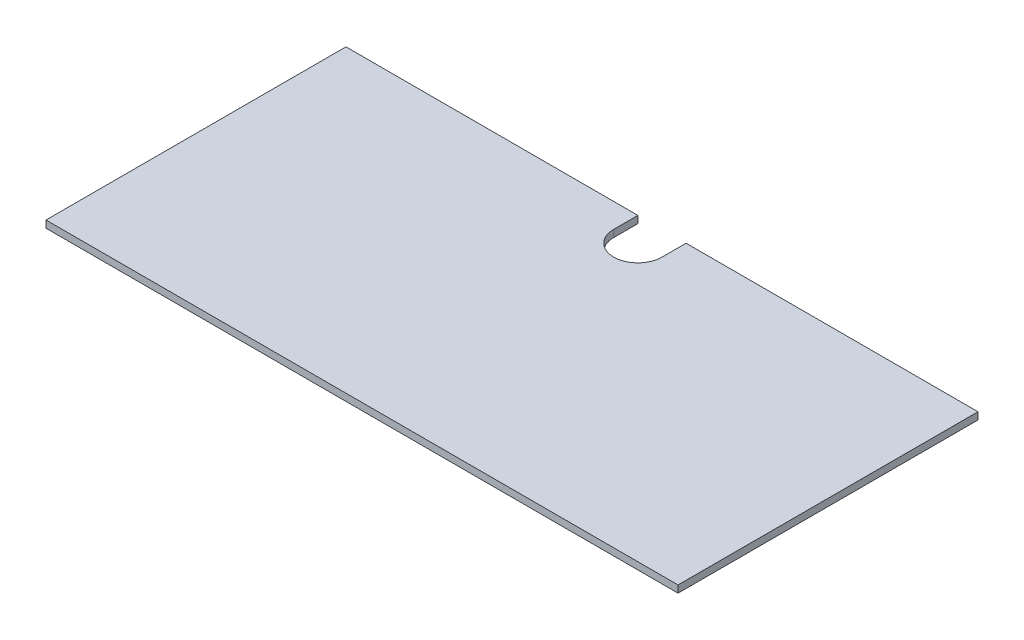
ISO-10303-21;
HEADER;
FILE_DESCRIPTION(('STEP AP214'),'2;1');
FILE_NAME('part.step','',(''),(''),'','','');
FILE_SCHEMA(('AUTOMOTIVE_DESIGN { 1 0 10303 214 1 1 1 1 }'));
ENDSEC;
DATA;
#1=APPLICATION_CONTEXT('core data for automotive mechanical design processes');
#2=APPLICATION_PROTOCOL_DEFINITION('international standard','automotive_design',2000,#1);
#3=PRODUCT_CONTEXT('',#1,'mechanical');
#4=PRODUCT('Part','Part','',(#3));
#5=PRODUCT_RELATED_PRODUCT_CATEGORY('part','',(#4));
#6=PRODUCT_DEFINITION_FORMATION('','',#4);
#7=PRODUCT_DEFINITION_CONTEXT('part definition',#1,'design');
#8=PRODUCT_DEFINITION('design','',#6,#7);
#9=PRODUCT_DEFINITION_SHAPE('','',#8);
#10=(LENGTH_UNIT() NAMED_UNIT(*) SI_UNIT(.MILLI.,.METRE.));
#11=(NAMED_UNIT(*) PLANE_ANGLE_UNIT() SI_UNIT($,.RADIAN.));
#12=(NAMED_UNIT(*) SI_UNIT($,.STERADIAN.) SOLID_ANGLE_UNIT());
#13=UNCERTAINTY_MEASURE_WITH_UNIT(LENGTH_MEASURE(1.E-05),#10,'distance_accuracy_value','');
#14=(GEOMETRIC_REPRESENTATION_CONTEXT(3) GLOBAL_UNCERTAINTY_ASSIGNED_CONTEXT((#13)) GLOBAL_UNIT_ASSIGNED_CONTEXT((#10,
#11,#12)) REPRESENTATION_CONTEXT('',''));
#15=CARTESIAN_POINT('',(0.,0.,0.));
#16=DIRECTION('',(0.,0.,1.));
#17=DIRECTION('',(1.,0.,0.));
#18=AXIS2_PLACEMENT_3D('',#15,#16,#17);
#19=CARTESIAN_POINT('',(0.,6.35,0.));
#20=DIRECTION('',(1.,0.,0.));
#21=DIRECTION('',(0.,0.,-1.));
#22=AXIS2_PLACEMENT_3D('',#19,#20,#21);
#23=PLANE('',#22);
#24=DIRECTION('',(0.,0.,1.));
#25=VECTOR('',#24,1.);
#26=CARTESIAN_POINT('',(0.,0.,0.));
#27=LINE('',#26,#25);
#28=CARTESIAN_POINT('',(0.,0.,-266.7));
#29=VERTEX_POINT('',#28);
#30=CARTESIAN_POINT('',(0.,0.,0.));
#31=VERTEX_POINT('',#30);
#32=EDGE_CURVE('E129',#29,#31,#27,.T.);
#33=ORIENTED_EDGE('',*,*,#32,.T.);
#34=DIRECTION('',(0.,-1.,0.));
#35=VECTOR('',#34,1.);
#36=CARTESIAN_POINT('',(0.,6.35,0.));
#37=LINE('',#36,#35);
#38=CARTESIAN_POINT('',(0.,6.35,0.));
#39=VERTEX_POINT('',#38);
#40=EDGE_CURVE('E11',#39,#31,#37,.T.);
#41=ORIENTED_EDGE('',*,*,#40,.F.);
#42=DIRECTION('',(0.,0.,1.));
#43=VECTOR('',#42,1.);
#44=CARTESIAN_POINT('',(0.,6.35,0.));
#45=LINE('',#44,#43);
#46=CARTESIAN_POINT('',(0.,6.35,-266.7));
#47=VERTEX_POINT('',#46);
#48=EDGE_CURVE('E143',#47,#39,#45,.T.);
#49=ORIENTED_EDGE('',*,*,#48,.F.);
#50=DIRECTION('',(0.,-1.,0.));
#51=VECTOR('',#50,1.);
#52=CARTESIAN_POINT('',(0.,6.35,-266.7));
#53=LINE('',#52,#51);
#54=EDGE_CURVE('E125',#47,#29,#53,.T.);
#55=ORIENTED_EDGE('',*,*,#54,.T.);
#56=EDGE_LOOP('',(#33,#41,#49,#55));
#57=FACE_BOUND('',#56,.T.);
#58=ADVANCED_FACE('F33',(#57),#23,.F.);
#59=CARTESIAN_POINT('',(0.,6.35,0.));
#60=DIRECTION('',(0.,0.,-1.));
#61=DIRECTION('',(-1.,0.,0.));
#62=AXIS2_PLACEMENT_3D('',#59,#60,#61);
#63=PLANE('',#62);
#64=DIRECTION('',(1.,0.,0.));
#65=VECTOR('',#64,1.);
#66=CARTESIAN_POINT('',(0.,0.,0.));
#67=LINE('',#66,#65);
#68=CARTESIAN_POINT('',(561.975,0.,0.));
#69=VERTEX_POINT('',#68);
#70=EDGE_CURVE('E132',#31,#69,#67,.T.);
#71=ORIENTED_EDGE('',*,*,#70,.T.);
#72=DIRECTION('',(0.,-1.,0.));
#73=VECTOR('',#72,1.);
#74=CARTESIAN_POINT('',(561.975,6.35,0.));
#75=LINE('',#74,#73);
#76=CARTESIAN_POINT('',(561.975,6.35,0.));
#77=VERTEX_POINT('',#76);
#78=EDGE_CURVE('E41',#77,#69,#75,.T.);
#79=ORIENTED_EDGE('',*,*,#78,.F.);
#80=DIRECTION('',(1.,0.,0.));
#81=VECTOR('',#80,1.);
#82=CARTESIAN_POINT('',(0.,6.35,0.));
#83=LINE('',#82,#81);
#84=EDGE_CURVE('E92',#39,#77,#83,.T.);
#85=ORIENTED_EDGE('',*,*,#84,.F.);
#86=ORIENTED_EDGE('',*,*,#40,.T.);
#87=EDGE_LOOP('',(#71,#79,#85,#86));
#88=FACE_BOUND('',#87,.T.);
#89=ADVANCED_FACE('F178',(#88),#63,.F.);
#90=CARTESIAN_POINT('',(561.975,6.35,0.));
#91=DIRECTION('',(-1.,0.,0.));
#92=DIRECTION('',(0.,0.,1.));
#93=AXIS2_PLACEMENT_3D('',#90,#91,#92);
#94=PLANE('',#93);
#95=DIRECTION('',(0.,0.,-1.));
#96=VECTOR('',#95,1.);
#97=CARTESIAN_POINT('',(561.975,0.,0.));
#98=LINE('',#97,#96);
#99=CARTESIAN_POINT('',(561.975,0.,-266.7));
#100=VERTEX_POINT('',#99);
#101=EDGE_CURVE('E134',#69,#100,#98,.T.);
#102=ORIENTED_EDGE('',*,*,#101,.T.);
#103=DIRECTION('',(0.,-1.,0.));
#104=VECTOR('',#103,1.);
#105=CARTESIAN_POINT('',(561.975,6.35,-266.7));
#106=LINE('',#105,#104);
#107=CARTESIAN_POINT('',(561.975,6.35,-266.7));
#108=VERTEX_POINT('',#107);
#109=EDGE_CURVE('E150',#108,#100,#106,.T.);
#110=ORIENTED_EDGE('',*,*,#109,.F.);
#111=DIRECTION('',(0.,0.,-1.));
#112=VECTOR('',#111,1.);
#113=CARTESIAN_POINT('',(561.975,6.35,0.));
#114=LINE('',#113,#112);
#115=EDGE_CURVE('E158',#77,#108,#114,.T.);
#116=ORIENTED_EDGE('',*,*,#115,.F.);
#117=ORIENTED_EDGE('',*,*,#78,.T.);
#118=EDGE_LOOP('',(#102,#110,#116,#117));
#119=FACE_BOUND('',#118,.T.);
#120=ADVANCED_FACE('F156',(#119),#94,.F.);
#121=CARTESIAN_POINT('',(302.41875,6.35,-266.7));
#122=DIRECTION('',(0.,0.,1.));
#123=DIRECTION('',(1.,0.,0.));
#124=AXIS2_PLACEMENT_3D('',#121,#122,#123);
#125=PLANE('',#124);
#126=DIRECTION('',(-1.,0.,0.));
#127=VECTOR('',#126,1.);
#128=CARTESIAN_POINT('',(302.41875,0.,-266.7));
#129=LINE('',#128,#127);
#130=CARTESIAN_POINT('',(302.41875,0.,-266.7));
#131=VERTEX_POINT('',#130);
#132=EDGE_CURVE('E136',#100,#131,#129,.T.);
#133=ORIENTED_EDGE('',*,*,#132,.T.);
#134=DIRECTION('',(0.,-1.,0.));
#135=VECTOR('',#134,1.);
#136=CARTESIAN_POINT('',(302.41875,6.35,-266.7));
#137=LINE('',#136,#135);
#138=CARTESIAN_POINT('',(302.41875,6.35,-266.7));
#139=VERTEX_POINT('',#138);
#140=EDGE_CURVE('E147',#139,#131,#137,.T.);
#141=ORIENTED_EDGE('',*,*,#140,.F.);
#142=DIRECTION('',(-1.,0.,0.));
#143=VECTOR('',#142,1.);
#144=CARTESIAN_POINT('',(302.41875,6.35,-266.7));
#145=LINE('',#144,#143);
#146=EDGE_CURVE('E170',#108,#139,#145,.T.);
#147=ORIENTED_EDGE('',*,*,#146,.F.);
#148=ORIENTED_EDGE('',*,*,#109,.T.);
#149=EDGE_LOOP('',(#133,#141,#147,#148));
#150=FACE_BOUND('',#149,.T.);
#151=ADVANCED_FACE('F166',(#150),#125,.F.);
#152=CARTESIAN_POINT('',(302.41875,6.35,-266.7));
#153=DIRECTION('',(1.,0.,0.));
#154=DIRECTION('',(0.,0.,-1.));
#155=AXIS2_PLACEMENT_3D('',#152,#153,#154);
#156=PLANE('',#155);
#157=DIRECTION('',(0.,0.,1.));
#158=VECTOR('',#157,1.);
#159=CARTESIAN_POINT('',(302.41875,0.,-266.7));
#160=LINE('',#159,#158);
#161=CARTESIAN_POINT('',(302.41875,0.,-245.26875));
#162=VERTEX_POINT('',#161);
#163=EDGE_CURVE('E138',#131,#162,#160,.T.);
#164=ORIENTED_EDGE('',*,*,#163,.T.);
#165=DIRECTION('',(0.,-1.,0.));
#166=VECTOR('',#165,1.);
#167=CARTESIAN_POINT('',(302.41875,6.35,-245.26875));
#168=LINE('',#167,#166);
#169=CARTESIAN_POINT('',(302.41875,6.35,-245.26875));
#170=VERTEX_POINT('',#169);
#171=EDGE_CURVE('E120',#170,#162,#168,.T.);
#172=ORIENTED_EDGE('',*,*,#171,.F.);
#173=DIRECTION('',(0.,0.,1.));
#174=VECTOR('',#173,1.);
#175=CARTESIAN_POINT('',(302.41875,6.35,-266.7));
#176=LINE('',#175,#174);
#177=EDGE_CURVE('E111',#139,#170,#176,.T.);
#178=ORIENTED_EDGE('',*,*,#177,.F.);
#179=ORIENTED_EDGE('',*,*,#140,.T.);
#180=EDGE_LOOP('',(#164,#172,#178,#179));
#181=FACE_BOUND('',#180,.T.);
#182=ADVANCED_FACE('F169',(#181),#156,.F.);
#183=CARTESIAN_POINT('',(280.9875,6.35,-245.26875));
#184=DIRECTION('',(0.,-1.,0.));
#185=DIRECTION('',(0.,0.,-1.));
#186=AXIS2_PLACEMENT_3D('',#183,#184,#185);
#187=CYLINDRICAL_SURFACE('',#186,21.43125);
#188=CARTESIAN_POINT('',(280.9875,0.,-245.26875));
#189=DIRECTION('',(0.,-1.,0.));
#190=DIRECTION('',(0.,0.,1.));
#191=AXIS2_PLACEMENT_3D('',#188,#189,#190);
#192=CIRCLE('',#191,21.43125);
#193=CARTESIAN_POINT('',(259.55625,0.,-245.26875));
#194=VERTEX_POINT('',#193);
#195=EDGE_CURVE('E119',#162,#194,#192,.T.);
#196=ORIENTED_EDGE('',*,*,#195,.T.);
#197=DIRECTION('',(0.,-1.,0.));
#198=VECTOR('',#197,1.);
#199=CARTESIAN_POINT('',(259.55625,6.35,-245.26875));
#200=LINE('',#199,#198);
#201=CARTESIAN_POINT('',(259.55625,6.35,-245.26875));
#202=VERTEX_POINT('',#201);
#203=EDGE_CURVE('E116',#202,#194,#200,.T.);
#204=ORIENTED_EDGE('',*,*,#203,.F.);
#205=CARTESIAN_POINT('',(280.9875,6.35,-245.26875));
#206=DIRECTION('',(0.,-1.,0.));
#207=DIRECTION('',(0.,0.,1.));
#208=AXIS2_PLACEMENT_3D('',#205,#206,#207);
#209=CIRCLE('',#208,21.43125);
#210=EDGE_CURVE('E105',#170,#202,#209,.T.);
#211=ORIENTED_EDGE('',*,*,#210,.F.);
#212=ORIENTED_EDGE('',*,*,#171,.T.);
#213=EDGE_LOOP('',(#196,#204,#211,#212));
#214=FACE_BOUND('',#213,.T.);
#215=ADVANCED_FACE('F117',(#214),#187,.F.);
#216=CARTESIAN_POINT('',(259.55625,6.35,-266.7));
#217=DIRECTION('',(-1.,0.,0.));
#218=DIRECTION('',(0.,0.,1.));
#219=AXIS2_PLACEMENT_3D('',#216,#217,#218);
#220=PLANE('',#219);
#221=DIRECTION('',(0.,0.,-1.));
#222=VECTOR('',#221,1.);
#223=CARTESIAN_POINT('',(259.55625,0.,-266.7));
#224=LINE('',#223,#222);
#225=CARTESIAN_POINT('',(259.55625,0.,-266.7));
#226=VERTEX_POINT('',#225);
#227=EDGE_CURVE('E78',#194,#226,#224,.T.);
#228=ORIENTED_EDGE('',*,*,#227,.T.);
#229=DIRECTION('',(0.,-1.,0.));
#230=VECTOR('',#229,1.);
#231=CARTESIAN_POINT('',(259.55625,6.35,-266.7));
#232=LINE('',#231,#230);
#233=CARTESIAN_POINT('',(259.55625,6.35,-266.7));
#234=VERTEX_POINT('',#233);
#235=EDGE_CURVE('E121',#234,#226,#232,.T.);
#236=ORIENTED_EDGE('',*,*,#235,.F.);
#237=DIRECTION('',(0.,0.,-1.));
#238=VECTOR('',#237,1.);
#239=CARTESIAN_POINT('',(259.55625,6.35,-266.7));
#240=LINE('',#239,#238);
#241=EDGE_CURVE('E109',#202,#234,#240,.T.);
#242=ORIENTED_EDGE('',*,*,#241,.F.);
#243=ORIENTED_EDGE('',*,*,#203,.T.);
#244=EDGE_LOOP('',(#228,#236,#242,#243));
#245=FACE_BOUND('',#244,.T.);
#246=ADVANCED_FACE('F123',(#245),#220,.F.);
#247=CARTESIAN_POINT('',(0.,6.35,-266.7));
#248=DIRECTION('',(0.,0.,1.));
#249=DIRECTION('',(1.,0.,0.));
#250=AXIS2_PLACEMENT_3D('',#247,#248,#249);
#251=PLANE('',#250);
#252=DIRECTION('',(-1.,0.,0.));
#253=VECTOR('',#252,1.);
#254=CARTESIAN_POINT('',(0.,0.,-266.7));
#255=LINE('',#254,#253);
#256=EDGE_CURVE('E84',#226,#29,#255,.T.);
#257=ORIENTED_EDGE('',*,*,#256,.T.);
#258=ORIENTED_EDGE('',*,*,#54,.F.);
#259=DIRECTION('',(-1.,0.,0.));
#260=VECTOR('',#259,1.);
#261=CARTESIAN_POINT('',(0.,6.35,-266.7));
#262=LINE('',#261,#260);
#263=EDGE_CURVE('E49',#234,#47,#262,.T.);
#264=ORIENTED_EDGE('',*,*,#263,.F.);
#265=ORIENTED_EDGE('',*,*,#235,.T.);
#266=EDGE_LOOP('',(#257,#258,#264,#265));
#267=FACE_BOUND('',#266,.T.);
#268=ADVANCED_FACE('F194',(#267),#251,.F.);
#269=CARTESIAN_POINT('',(280.9875,6.35,-245.26875));
#270=DIRECTION('',(0.,1.,0.));
#271=DIRECTION('',(0.,0.,1.));
#272=AXIS2_PLACEMENT_3D('',#269,#270,#271);
#273=PLANE('',#272);
#274=ORIENTED_EDGE('',*,*,#48,.T.);
#275=ORIENTED_EDGE('',*,*,#84,.T.);
#276=ORIENTED_EDGE('',*,*,#115,.T.);
#277=ORIENTED_EDGE('',*,*,#146,.T.);
#278=ORIENTED_EDGE('',*,*,#177,.T.);
#279=ORIENTED_EDGE('',*,*,#210,.T.);
#280=ORIENTED_EDGE('',*,*,#241,.T.);
#281=ORIENTED_EDGE('',*,*,#263,.T.);
#282=EDGE_LOOP('',(#274,#275,#276,#277,#278,#279,#280,#281));
#283=FACE_BOUND('',#282,.T.);
#284=ADVANCED_FACE('F107',(#283),#273,.T.);
#285=CARTESIAN_POINT('',(280.9875,0.,-245.26875));
#286=DIRECTION('',(0.,1.,0.));
#287=DIRECTION('',(0.,0.,1.));
#288=AXIS2_PLACEMENT_3D('',#285,#286,#287);
#289=PLANE('',#288);
#290=ORIENTED_EDGE('',*,*,#32,.F.);
#291=ORIENTED_EDGE('',*,*,#256,.F.);
#292=ORIENTED_EDGE('',*,*,#227,.F.);
#293=ORIENTED_EDGE('',*,*,#195,.F.);
#294=ORIENTED_EDGE('',*,*,#163,.F.);
#295=ORIENTED_EDGE('',*,*,#132,.F.);
#296=ORIENTED_EDGE('',*,*,#101,.F.);
#297=ORIENTED_EDGE('',*,*,#70,.F.);
#298=EDGE_LOOP('',(#290,#291,#292,#293,#294,#295,#296,#297));
#299=FACE_BOUND('',#298,.T.);
#300=ADVANCED_FACE('F162',(#299),#289,.F.);
#301=CLOSED_SHELL('',(#58,#89,#120,#151,#182,#215,#246,#268,#284,#300));
#302=MANIFOLD_SOLID_BREP('B2',#301);
#303=ADVANCED_BREP_SHAPE_REPRESENTATION('',(#18,#302),#14);
#304=SHAPE_DEFINITION_REPRESENTATION(#9,#303);
ENDSEC;
END-ISO-10303-21;
